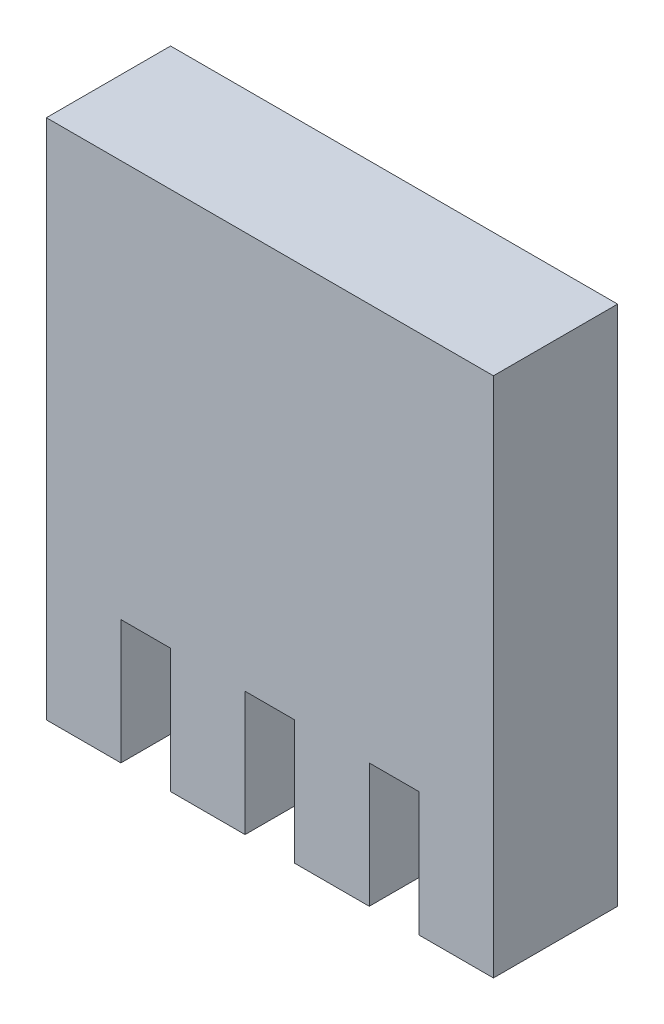
ISO-10303-21;
HEADER;
FILE_DESCRIPTION(('STEP AP214'),'2;1');
FILE_NAME('part.step','',(''),(''),'','','');
FILE_SCHEMA(('AUTOMOTIVE_DESIGN { 1 0 10303 214 1 1 1 1 }'));
ENDSEC;
DATA;
#1=APPLICATION_CONTEXT('core data for automotive mechanical design processes');
#2=APPLICATION_PROTOCOL_DEFINITION('international standard','automotive_design',2000,#1);
#3=PRODUCT_CONTEXT('',#1,'mechanical');
#4=PRODUCT('Part','Part','',(#3));
#5=PRODUCT_RELATED_PRODUCT_CATEGORY('part','',(#4));
#6=PRODUCT_DEFINITION_FORMATION('','',#4);
#7=PRODUCT_DEFINITION_CONTEXT('part definition',#1,'design');
#8=PRODUCT_DEFINITION('design','',#6,#7);
#9=PRODUCT_DEFINITION_SHAPE('','',#8);
#10=(LENGTH_UNIT() NAMED_UNIT(*) SI_UNIT(.MILLI.,.METRE.));
#11=(NAMED_UNIT(*) PLANE_ANGLE_UNIT() SI_UNIT($,.RADIAN.));
#12=(NAMED_UNIT(*) SI_UNIT($,.STERADIAN.) SOLID_ANGLE_UNIT());
#13=UNCERTAINTY_MEASURE_WITH_UNIT(LENGTH_MEASURE(1.E-05),#10,'distance_accuracy_value','');
#14=(GEOMETRIC_REPRESENTATION_CONTEXT(3) GLOBAL_UNCERTAINTY_ASSIGNED_CONTEXT((#13)) GLOBAL_UNIT_ASSIGNED_CONTEXT((#10,
#11,#12)) REPRESENTATION_CONTEXT('',''));
#15=CARTESIAN_POINT('',(0.,0.,0.));
#16=DIRECTION('',(0.,0.,1.));
#17=DIRECTION('',(1.,0.,0.));
#18=AXIS2_PLACEMENT_3D('',#15,#16,#17);
#19=CARTESIAN_POINT('',(0.,0.,5.));
#20=DIRECTION('',(0.,1.,0.));
#21=DIRECTION('',(0.,0.,1.));
#22=AXIS2_PLACEMENT_3D('',#19,#20,#21);
#23=PLANE('',#22);
#24=DIRECTION('',(0.,0.,-1.));
#25=VECTOR('',#24,1.);
#26=CARTESIAN_POINT('',(5.,0.,5.));
#27=LINE('',#26,#25);
#28=CARTESIAN_POINT('',(5.,0.,5.));
#29=VERTEX_POINT('',#28);
#30=CARTESIAN_POINT('',(5.,0.,0.));
#31=VERTEX_POINT('',#30);
#32=EDGE_CURVE('E12',#29,#31,#27,.T.);
#33=ORIENTED_EDGE('',*,*,#32,.F.);
#34=DIRECTION('',(1.,0.,0.));
#35=VECTOR('',#34,1.);
#36=CARTESIAN_POINT('',(0.,0.,5.));
#37=LINE('',#36,#35);
#38=CARTESIAN_POINT('',(3.,0.,5.));
#39=VERTEX_POINT('',#38);
#40=EDGE_CURVE('E252',#39,#29,#37,.T.);
#41=ORIENTED_EDGE('',*,*,#40,.F.);
#42=DIRECTION('',(0.,0.,-1.));
#43=VECTOR('',#42,1.);
#44=CARTESIAN_POINT('',(3.,0.,5.));
#45=LINE('',#44,#43);
#46=CARTESIAN_POINT('',(3.,0.,0.));
#47=VERTEX_POINT('',#46);
#48=EDGE_CURVE('E184',#39,#47,#45,.T.);
#49=ORIENTED_EDGE('',*,*,#48,.T.);
#50=DIRECTION('',(1.,0.,0.));
#51=VECTOR('',#50,1.);
#52=CARTESIAN_POINT('',(0.,0.,0.));
#53=LINE('',#52,#51);
#54=EDGE_CURVE('E220',#47,#31,#53,.T.);
#55=ORIENTED_EDGE('',*,*,#54,.T.);
#56=EDGE_LOOP('',(#33,#41,#49,#55));
#57=FACE_BOUND('',#56,.T.);
#58=ADVANCED_FACE('F82',(#57),#23,.F.);
#59=CARTESIAN_POINT('',(8.,0.,5.));
#60=VERTEX_POINT('',#59);
#61=CARTESIAN_POINT('',(10.,0.,5.));
#62=VERTEX_POINT('',#61);
#63=EDGE_CURVE('E191',#60,#62,#37,.T.);
#64=ORIENTED_EDGE('',*,*,#63,.F.);
#65=DIRECTION('',(0.,0.,-1.));
#66=VECTOR('',#65,1.);
#67=CARTESIAN_POINT('',(8.,0.,5.));
#68=LINE('',#67,#66);
#69=CARTESIAN_POINT('',(8.,0.,0.));
#70=VERTEX_POINT('',#69);
#71=EDGE_CURVE('E92',#60,#70,#68,.T.);
#72=ORIENTED_EDGE('',*,*,#71,.T.);
#73=CARTESIAN_POINT('',(10.,0.,0.));
#74=VERTEX_POINT('',#73);
#75=EDGE_CURVE('E139',#70,#74,#53,.T.);
#76=ORIENTED_EDGE('',*,*,#75,.T.);
#77=DIRECTION('',(0.,0.,-1.));
#78=VECTOR('',#77,1.);
#79=CARTESIAN_POINT('',(10.,0.,5.));
#80=LINE('',#79,#78);
#81=EDGE_CURVE('E151',#62,#74,#80,.T.);
#82=ORIENTED_EDGE('',*,*,#81,.F.);
#83=EDGE_LOOP('',(#64,#72,#76,#82));
#84=FACE_BOUND('',#83,.T.);
#85=ADVANCED_FACE('F329',(#84),#23,.F.);
#86=CARTESIAN_POINT('',(10.,0.,5.));
#87=DIRECTION('',(-1.,0.,0.));
#88=DIRECTION('',(0.,0.,1.));
#89=AXIS2_PLACEMENT_3D('',#86,#87,#88);
#90=PLANE('',#89);
#91=DIRECTION('',(0.,1.,0.));
#92=VECTOR('',#91,1.);
#93=CARTESIAN_POINT('',(10.,0.,0.));
#94=LINE('',#93,#92);
#95=CARTESIAN_POINT('',(10.,-5.,0.));
#96=VERTEX_POINT('',#95);
#97=EDGE_CURVE('E217',#96,#74,#94,.T.);
#98=ORIENTED_EDGE('',*,*,#97,.F.);
#99=DIRECTION('',(0.,0.,-1.));
#100=VECTOR('',#99,1.);
#101=CARTESIAN_POINT('',(10.,-5.,5.));
#102=LINE('',#101,#100);
#103=CARTESIAN_POINT('',(10.,-5.,5.));
#104=VERTEX_POINT('',#103);
#105=EDGE_CURVE('E154',#104,#96,#102,.T.);
#106=ORIENTED_EDGE('',*,*,#105,.F.);
#107=DIRECTION('',(0.,1.,0.));
#108=VECTOR('',#107,1.);
#109=CARTESIAN_POINT('',(10.,0.,5.));
#110=LINE('',#109,#108);
#111=EDGE_CURVE('E249',#104,#62,#110,.T.);
#112=ORIENTED_EDGE('',*,*,#111,.T.);
#113=ORIENTED_EDGE('',*,*,#81,.T.);
#114=EDGE_LOOP('',(#98,#106,#112,#113));
#115=FACE_BOUND('',#114,.T.);
#116=ADVANCED_FACE('F336',(#115),#90,.T.);
#117=CARTESIAN_POINT('',(0.,-5.,5.));
#118=DIRECTION('',(0.,1.,0.));
#119=DIRECTION('',(0.,0.,1.));
#120=AXIS2_PLACEMENT_3D('',#117,#118,#119);
#121=PLANE('',#120);
#122=DIRECTION('',(1.,0.,0.));
#123=VECTOR('',#122,1.);
#124=CARTESIAN_POINT('',(0.,-5.,0.));
#125=LINE('',#124,#123);
#126=CARTESIAN_POINT('',(13.,-5.,0.));
#127=VERTEX_POINT('',#126);
#128=EDGE_CURVE('E214',#96,#127,#125,.T.);
#129=ORIENTED_EDGE('',*,*,#128,.T.);
#130=DIRECTION('',(0.,0.,-1.));
#131=VECTOR('',#130,1.);
#132=CARTESIAN_POINT('',(13.,-5.,5.));
#133=LINE('',#132,#131);
#134=CARTESIAN_POINT('',(13.,-5.,5.));
#135=VERTEX_POINT('',#134);
#136=EDGE_CURVE('E157',#135,#127,#133,.T.);
#137=ORIENTED_EDGE('',*,*,#136,.F.);
#138=DIRECTION('',(1.,0.,0.));
#139=VECTOR('',#138,1.);
#140=CARTESIAN_POINT('',(0.,-5.,5.));
#141=LINE('',#140,#139);
#142=EDGE_CURVE('E246',#104,#135,#141,.T.);
#143=ORIENTED_EDGE('',*,*,#142,.F.);
#144=ORIENTED_EDGE('',*,*,#105,.T.);
#145=EDGE_LOOP('',(#129,#137,#143,#144));
#146=FACE_BOUND('',#145,.T.);
#147=ADVANCED_FACE('F347',(#146),#121,.F.);
#148=CARTESIAN_POINT('',(13.,0.,5.));
#149=DIRECTION('',(-1.,0.,0.));
#150=DIRECTION('',(0.,0.,1.));
#151=AXIS2_PLACEMENT_3D('',#148,#149,#150);
#152=PLANE('',#151);
#153=DIRECTION('',(0.,1.,0.));
#154=VECTOR('',#153,1.);
#155=CARTESIAN_POINT('',(13.,0.,0.));
#156=LINE('',#155,#154);
#157=CARTESIAN_POINT('',(13.,0.,0.));
#158=VERTEX_POINT('',#157);
#159=EDGE_CURVE('E211',#127,#158,#156,.T.);
#160=ORIENTED_EDGE('',*,*,#159,.T.);
#161=DIRECTION('',(0.,0.,-1.));
#162=VECTOR('',#161,1.);
#163=CARTESIAN_POINT('',(13.,0.,5.));
#164=LINE('',#163,#162);
#165=CARTESIAN_POINT('',(13.,0.,5.));
#166=VERTEX_POINT('',#165);
#167=EDGE_CURVE('E160',#166,#158,#164,.T.);
#168=ORIENTED_EDGE('',*,*,#167,.F.);
#169=DIRECTION('',(0.,1.,0.));
#170=VECTOR('',#169,1.);
#171=CARTESIAN_POINT('',(13.,0.,5.));
#172=LINE('',#171,#170);
#173=EDGE_CURVE('E243',#135,#166,#172,.T.);
#174=ORIENTED_EDGE('',*,*,#173,.F.);
#175=ORIENTED_EDGE('',*,*,#136,.T.);
#176=EDGE_LOOP('',(#160,#168,#174,#175));
#177=FACE_BOUND('',#176,.T.);
#178=ADVANCED_FACE('F349',(#177),#152,.F.);
#179=CARTESIAN_POINT('',(15.,0.,0.));
#180=VERTEX_POINT('',#179);
#181=EDGE_CURVE('E210',#158,#180,#53,.T.);
#182=ORIENTED_EDGE('',*,*,#181,.T.);
#183=DIRECTION('',(0.,0.,-1.));
#184=VECTOR('',#183,1.);
#185=CARTESIAN_POINT('',(15.,0.,5.));
#186=LINE('',#185,#184);
#187=CARTESIAN_POINT('',(15.,0.,5.));
#188=VERTEX_POINT('',#187);
#189=EDGE_CURVE('E163',#188,#180,#186,.T.);
#190=ORIENTED_EDGE('',*,*,#189,.F.);
#191=EDGE_CURVE('E242',#166,#188,#37,.T.);
#192=ORIENTED_EDGE('',*,*,#191,.F.);
#193=ORIENTED_EDGE('',*,*,#167,.T.);
#194=EDGE_LOOP('',(#182,#190,#192,#193));
#195=FACE_BOUND('',#194,.T.);
#196=ADVANCED_FACE('F271',(#195),#23,.F.);
#197=CARTESIAN_POINT('',(15.,0.,5.));
#198=DIRECTION('',(-1.,0.,0.));
#199=DIRECTION('',(0.,0.,1.));
#200=AXIS2_PLACEMENT_3D('',#197,#198,#199);
#201=PLANE('',#200);
#202=DIRECTION('',(0.,1.,0.));
#203=VECTOR('',#202,1.);
#204=CARTESIAN_POINT('',(15.,0.,0.));
#205=LINE('',#204,#203);
#206=CARTESIAN_POINT('',(15.,-5.,0.));
#207=VERTEX_POINT('',#206);
#208=EDGE_CURVE('E207',#207,#180,#205,.T.);
#209=ORIENTED_EDGE('',*,*,#208,.F.);
#210=DIRECTION('',(0.,0.,-1.));
#211=VECTOR('',#210,1.);
#212=CARTESIAN_POINT('',(15.,-5.,5.));
#213=LINE('',#212,#211);
#214=CARTESIAN_POINT('',(15.,-5.,5.));
#215=VERTEX_POINT('',#214);
#216=EDGE_CURVE('E166',#215,#207,#213,.T.);
#217=ORIENTED_EDGE('',*,*,#216,.F.);
#218=DIRECTION('',(0.,1.,0.));
#219=VECTOR('',#218,1.);
#220=CARTESIAN_POINT('',(15.,0.,5.));
#221=LINE('',#220,#219);
#222=EDGE_CURVE('E239',#215,#188,#221,.T.);
#223=ORIENTED_EDGE('',*,*,#222,.T.);
#224=ORIENTED_EDGE('',*,*,#189,.T.);
#225=EDGE_LOOP('',(#209,#217,#223,#224));
#226=FACE_BOUND('',#225,.T.);
#227=ADVANCED_FACE('F277',(#226),#201,.T.);
#228=CARTESIAN_POINT('',(0.,-5.,5.));
#229=DIRECTION('',(0.,1.,0.));
#230=DIRECTION('',(0.,0.,1.));
#231=AXIS2_PLACEMENT_3D('',#228,#229,#230);
#232=PLANE('',#231);
#233=DIRECTION('',(1.,0.,0.));
#234=VECTOR('',#233,1.);
#235=CARTESIAN_POINT('',(0.,-5.,0.));
#236=LINE('',#235,#234);
#237=CARTESIAN_POINT('',(18.,-5.,0.));
#238=VERTEX_POINT('',#237);
#239=EDGE_CURVE('E204',#207,#238,#236,.T.);
#240=ORIENTED_EDGE('',*,*,#239,.T.);
#241=DIRECTION('',(0.,0.,-1.));
#242=VECTOR('',#241,1.);
#243=CARTESIAN_POINT('',(18.,-5.,5.));
#244=LINE('',#243,#242);
#245=CARTESIAN_POINT('',(18.,-5.,5.));
#246=VERTEX_POINT('',#245);
#247=EDGE_CURVE('E169',#246,#238,#244,.T.);
#248=ORIENTED_EDGE('',*,*,#247,.F.);
#249=DIRECTION('',(1.,0.,0.));
#250=VECTOR('',#249,1.);
#251=CARTESIAN_POINT('',(0.,-5.,5.));
#252=LINE('',#251,#250);
#253=EDGE_CURVE('E236',#215,#246,#252,.T.);
#254=ORIENTED_EDGE('',*,*,#253,.F.);
#255=ORIENTED_EDGE('',*,*,#216,.T.);
#256=EDGE_LOOP('',(#240,#248,#254,#255));
#257=FACE_BOUND('',#256,.T.);
#258=ADVANCED_FACE('F285',(#257),#232,.F.);
#259=CARTESIAN_POINT('',(18.,0.,5.));
#260=DIRECTION('',(-1.,0.,0.));
#261=DIRECTION('',(0.,0.,1.));
#262=AXIS2_PLACEMENT_3D('',#259,#260,#261);
#263=PLANE('',#262);
#264=DIRECTION('',(0.,1.,0.));
#265=VECTOR('',#264,1.);
#266=CARTESIAN_POINT('',(18.,0.,0.));
#267=LINE('',#266,#265);
#268=CARTESIAN_POINT('',(18.,16.,0.));
#269=VERTEX_POINT('',#268);
#270=EDGE_CURVE('E201',#238,#269,#267,.T.);
#271=ORIENTED_EDGE('',*,*,#270,.T.);
#272=DIRECTION('',(0.,0.,-1.));
#273=VECTOR('',#272,1.);
#274=CARTESIAN_POINT('',(18.,16.,5.));
#275=LINE('',#274,#273);
#276=CARTESIAN_POINT('',(18.,16.,5.));
#277=VERTEX_POINT('',#276);
#278=EDGE_CURVE('E172',#277,#269,#275,.T.);
#279=ORIENTED_EDGE('',*,*,#278,.F.);
#280=DIRECTION('',(0.,1.,0.));
#281=VECTOR('',#280,1.);
#282=CARTESIAN_POINT('',(18.,0.,5.));
#283=LINE('',#282,#281);
#284=EDGE_CURVE('E233',#246,#277,#283,.T.);
#285=ORIENTED_EDGE('',*,*,#284,.F.);
#286=ORIENTED_EDGE('',*,*,#247,.T.);
#287=EDGE_LOOP('',(#271,#279,#285,#286));
#288=FACE_BOUND('',#287,.T.);
#289=ADVANCED_FACE('F352',(#288),#263,.F.);
#290=CARTESIAN_POINT('',(0.,16.,5.));
#291=DIRECTION('',(0.,1.,0.));
#292=DIRECTION('',(0.,0.,1.));
#293=AXIS2_PLACEMENT_3D('',#290,#291,#292);
#294=PLANE('',#293);
#295=DIRECTION('',(1.,0.,0.));
#296=VECTOR('',#295,1.);
#297=CARTESIAN_POINT('',(0.,16.,0.));
#298=LINE('',#297,#296);
#299=CARTESIAN_POINT('',(0.,16.,0.));
#300=VERTEX_POINT('',#299);
#301=EDGE_CURVE('E198',#300,#269,#298,.T.);
#302=ORIENTED_EDGE('',*,*,#301,.F.);
#303=DIRECTION('',(0.,0.,-1.));
#304=VECTOR('',#303,1.);
#305=CARTESIAN_POINT('',(0.,16.,5.));
#306=LINE('',#305,#304);
#307=CARTESIAN_POINT('',(0.,16.,5.));
#308=VERTEX_POINT('',#307);
#309=EDGE_CURVE('E175',#308,#300,#306,.T.);
#310=ORIENTED_EDGE('',*,*,#309,.F.);
#311=DIRECTION('',(1.,0.,0.));
#312=VECTOR('',#311,1.);
#313=CARTESIAN_POINT('',(0.,16.,5.));
#314=LINE('',#313,#312);
#315=EDGE_CURVE('E230',#308,#277,#314,.T.);
#316=ORIENTED_EDGE('',*,*,#315,.T.);
#317=ORIENTED_EDGE('',*,*,#278,.T.);
#318=EDGE_LOOP('',(#302,#310,#316,#317));
#319=FACE_BOUND('',#318,.T.);
#320=ADVANCED_FACE('F355',(#319),#294,.T.);
#321=CARTESIAN_POINT('',(0.,0.,5.));
#322=DIRECTION('',(-1.,0.,0.));
#323=DIRECTION('',(0.,0.,1.));
#324=AXIS2_PLACEMENT_3D('',#321,#322,#323);
#325=PLANE('',#324);
#326=DIRECTION('',(0.,1.,0.));
#327=VECTOR('',#326,1.);
#328=CARTESIAN_POINT('',(0.,0.,0.));
#329=LINE('',#328,#327);
#330=CARTESIAN_POINT('',(0.,-5.,0.));
#331=VERTEX_POINT('',#330);
#332=EDGE_CURVE('E195',#331,#300,#329,.T.);
#333=ORIENTED_EDGE('',*,*,#332,.F.);
#334=DIRECTION('',(0.,0.,-1.));
#335=VECTOR('',#334,1.);
#336=CARTESIAN_POINT('',(0.,-5.,5.));
#337=LINE('',#336,#335);
#338=CARTESIAN_POINT('',(0.,-5.,5.));
#339=VERTEX_POINT('',#338);
#340=EDGE_CURVE('E178',#339,#331,#337,.T.);
#341=ORIENTED_EDGE('',*,*,#340,.F.);
#342=DIRECTION('',(0.,1.,0.));
#343=VECTOR('',#342,1.);
#344=CARTESIAN_POINT('',(0.,0.,5.));
#345=LINE('',#344,#343);
#346=EDGE_CURVE('E227',#339,#308,#345,.T.);
#347=ORIENTED_EDGE('',*,*,#346,.T.);
#348=ORIENTED_EDGE('',*,*,#309,.T.);
#349=EDGE_LOOP('',(#333,#341,#347,#348));
#350=FACE_BOUND('',#349,.T.);
#351=ADVANCED_FACE('F359',(#350),#325,.T.);
#352=CARTESIAN_POINT('',(0.,-5.,5.));
#353=DIRECTION('',(0.,1.,0.));
#354=DIRECTION('',(0.,0.,1.));
#355=AXIS2_PLACEMENT_3D('',#352,#353,#354);
#356=PLANE('',#355);
#357=DIRECTION('',(1.,0.,0.));
#358=VECTOR('',#357,1.);
#359=CARTESIAN_POINT('',(0.,-5.,0.));
#360=LINE('',#359,#358);
#361=CARTESIAN_POINT('',(3.,-5.,0.));
#362=VERTEX_POINT('',#361);
#363=EDGE_CURVE('E192',#331,#362,#360,.T.);
#364=ORIENTED_EDGE('',*,*,#363,.T.);
#365=DIRECTION('',(0.,0.,-1.));
#366=VECTOR('',#365,1.);
#367=CARTESIAN_POINT('',(3.,-5.,5.));
#368=LINE('',#367,#366);
#369=CARTESIAN_POINT('',(3.,-5.,5.));
#370=VERTEX_POINT('',#369);
#371=EDGE_CURVE('E181',#370,#362,#368,.T.);
#372=ORIENTED_EDGE('',*,*,#371,.F.);
#373=DIRECTION('',(1.,0.,0.));
#374=VECTOR('',#373,1.);
#375=CARTESIAN_POINT('',(0.,-5.,5.));
#376=LINE('',#375,#374);
#377=EDGE_CURVE('E224',#339,#370,#376,.T.);
#378=ORIENTED_EDGE('',*,*,#377,.F.);
#379=ORIENTED_EDGE('',*,*,#340,.T.);
#380=EDGE_LOOP('',(#364,#372,#378,#379));
#381=FACE_BOUND('',#380,.T.);
#382=ADVANCED_FACE('F364',(#381),#356,.F.);
#383=CARTESIAN_POINT('',(3.,0.,5.));
#384=DIRECTION('',(1.,0.,0.));
#385=DIRECTION('',(0.,1.,0.));
#386=AXIS2_PLACEMENT_3D('',#383,#384,#385);
#387=PLANE('',#386);
#388=DIRECTION('',(0.,-1.,0.));
#389=VECTOR('',#388,1.);
#390=CARTESIAN_POINT('',(3.,0.,0.));
#391=LINE('',#390,#389);
#392=EDGE_CURVE('E188',#47,#362,#391,.T.);
#393=ORIENTED_EDGE('',*,*,#392,.F.);
#394=ORIENTED_EDGE('',*,*,#48,.F.);
#395=DIRECTION('',(0.,-1.,0.));
#396=VECTOR('',#395,1.);
#397=CARTESIAN_POINT('',(3.,0.,5.));
#398=LINE('',#397,#396);
#399=EDGE_CURVE('E187',#39,#370,#398,.T.);
#400=ORIENTED_EDGE('',*,*,#399,.T.);
#401=ORIENTED_EDGE('',*,*,#371,.T.);
#402=EDGE_LOOP('',(#393,#394,#400,#401));
#403=FACE_BOUND('',#402,.T.);
#404=ADVANCED_FACE('F367',(#403),#387,.T.);
#405=CARTESIAN_POINT('',(0.,0.,5.));
#406=DIRECTION('',(0.,0.,1.));
#407=DIRECTION('',(1.,0.,0.));
#408=AXIS2_PLACEMENT_3D('',#405,#406,#407);
#409=PLANE('',#408);
#410=ORIENTED_EDGE('',*,*,#40,.T.);
#411=DIRECTION('',(0.,-1.,0.));
#412=VECTOR('',#411,1.);
#413=CARTESIAN_POINT('',(5.,0.,5.));
#414=LINE('',#413,#412);
#415=CARTESIAN_POINT('',(5.,-5.,5.));
#416=VERTEX_POINT('',#415);
#417=EDGE_CURVE('E146',#29,#416,#414,.T.);
#418=ORIENTED_EDGE('',*,*,#417,.T.);
#419=DIRECTION('',(1.,0.,0.));
#420=VECTOR('',#419,1.);
#421=CARTESIAN_POINT('',(5.,-5.,5.));
#422=LINE('',#421,#420);
#423=CARTESIAN_POINT('',(8.,-5.,5.));
#424=VERTEX_POINT('',#423);
#425=EDGE_CURVE('E138',#416,#424,#422,.T.);
#426=ORIENTED_EDGE('',*,*,#425,.T.);
#427=DIRECTION('',(0.,-1.,0.));
#428=VECTOR('',#427,1.);
#429=CARTESIAN_POINT('',(8.,0.,5.));
#430=LINE('',#429,#428);
#431=EDGE_CURVE('E132',#60,#424,#430,.T.);
#432=ORIENTED_EDGE('',*,*,#431,.F.);
#433=ORIENTED_EDGE('',*,*,#63,.T.);
#434=ORIENTED_EDGE('',*,*,#111,.F.);
#435=ORIENTED_EDGE('',*,*,#142,.T.);
#436=ORIENTED_EDGE('',*,*,#173,.T.);
#437=ORIENTED_EDGE('',*,*,#191,.T.);
#438=ORIENTED_EDGE('',*,*,#222,.F.);
#439=ORIENTED_EDGE('',*,*,#253,.T.);
#440=ORIENTED_EDGE('',*,*,#284,.T.);
#441=ORIENTED_EDGE('',*,*,#315,.F.);
#442=ORIENTED_EDGE('',*,*,#346,.F.);
#443=ORIENTED_EDGE('',*,*,#377,.T.);
#444=ORIENTED_EDGE('',*,*,#399,.F.);
#445=EDGE_LOOP('',(#410,#418,#426,#432,#433,#434,#435,#436,#437,#438,#439,#440,#441,#442,#443,#444));
#446=FACE_BOUND('',#445,.T.);
#447=ADVANCED_FACE('F263',(#446),#409,.T.);
#448=CARTESIAN_POINT('',(0.,0.,0.));
#449=DIRECTION('',(0.,0.,1.));
#450=DIRECTION('',(1.,0.,0.));
#451=AXIS2_PLACEMENT_3D('',#448,#449,#450);
#452=PLANE('',#451);
#453=ORIENTED_EDGE('',*,*,#54,.F.);
#454=ORIENTED_EDGE('',*,*,#392,.T.);
#455=ORIENTED_EDGE('',*,*,#363,.F.);
#456=ORIENTED_EDGE('',*,*,#332,.T.);
#457=ORIENTED_EDGE('',*,*,#301,.T.);
#458=ORIENTED_EDGE('',*,*,#270,.F.);
#459=ORIENTED_EDGE('',*,*,#239,.F.);
#460=ORIENTED_EDGE('',*,*,#208,.T.);
#461=ORIENTED_EDGE('',*,*,#181,.F.);
#462=ORIENTED_EDGE('',*,*,#159,.F.);
#463=ORIENTED_EDGE('',*,*,#128,.F.);
#464=ORIENTED_EDGE('',*,*,#97,.T.);
#465=ORIENTED_EDGE('',*,*,#75,.F.);
#466=DIRECTION('',(0.,-1.,0.));
#467=VECTOR('',#466,1.);
#468=CARTESIAN_POINT('',(8.,0.,0.));
#469=LINE('',#468,#467);
#470=CARTESIAN_POINT('',(8.,-5.,0.));
#471=VERTEX_POINT('',#470);
#472=EDGE_CURVE('E142',#70,#471,#469,.T.);
#473=ORIENTED_EDGE('',*,*,#472,.T.);
#474=DIRECTION('',(1.,0.,0.));
#475=VECTOR('',#474,1.);
#476=CARTESIAN_POINT('',(5.,-5.,0.));
#477=LINE('',#476,#475);
#478=CARTESIAN_POINT('',(5.,-5.,0.));
#479=VERTEX_POINT('',#478);
#480=EDGE_CURVE('E133',#479,#471,#477,.T.);
#481=ORIENTED_EDGE('',*,*,#480,.F.);
#482=DIRECTION('',(0.,-1.,0.));
#483=VECTOR('',#482,1.);
#484=CARTESIAN_POINT('',(5.,0.,0.));
#485=LINE('',#484,#483);
#486=EDGE_CURVE('E121',#31,#479,#485,.T.);
#487=ORIENTED_EDGE('',*,*,#486,.F.);
#488=EDGE_LOOP('',(#453,#454,#455,#456,#457,#458,#459,#460,#461,#462,#463,#464,#465,#473,#481,#487));
#489=FACE_BOUND('',#488,.T.);
#490=ADVANCED_FACE('F140',(#489),#452,.F.);
#491=CARTESIAN_POINT('',(5.,0.,5.));
#492=DIRECTION('',(1.,0.,0.));
#493=DIRECTION('',(0.,0.,-1.));
#494=AXIS2_PLACEMENT_3D('',#491,#492,#493);
#495=PLANE('',#494);
#496=ORIENTED_EDGE('',*,*,#486,.T.);
#497=DIRECTION('',(0.,0.,-1.));
#498=VECTOR('',#497,1.);
#499=CARTESIAN_POINT('',(5.,-5.,5.));
#500=LINE('',#499,#498);
#501=EDGE_CURVE('E125',#416,#479,#500,.T.);
#502=ORIENTED_EDGE('',*,*,#501,.F.);
#503=ORIENTED_EDGE('',*,*,#417,.F.);
#504=ORIENTED_EDGE('',*,*,#32,.T.);
#505=EDGE_LOOP('',(#496,#502,#503,#504));
#506=FACE_BOUND('',#505,.T.);
#507=ADVANCED_FACE('F123',(#506),#495,.F.);
#508=CARTESIAN_POINT('',(5.,-5.,5.));
#509=DIRECTION('',(0.,1.,0.));
#510=DIRECTION('',(0.,0.,1.));
#511=AXIS2_PLACEMENT_3D('',#508,#509,#510);
#512=PLANE('',#511);
#513=ORIENTED_EDGE('',*,*,#480,.T.);
#514=DIRECTION('',(0.,0.,-1.));
#515=VECTOR('',#514,1.);
#516=CARTESIAN_POINT('',(8.,-5.,5.));
#517=LINE('',#516,#515);
#518=EDGE_CURVE('E86',#424,#471,#517,.T.);
#519=ORIENTED_EDGE('',*,*,#518,.F.);
#520=ORIENTED_EDGE('',*,*,#425,.F.);
#521=ORIENTED_EDGE('',*,*,#501,.T.);
#522=EDGE_LOOP('',(#513,#519,#520,#521));
#523=FACE_BOUND('',#522,.T.);
#524=ADVANCED_FACE('F136',(#523),#512,.F.);
#525=CARTESIAN_POINT('',(8.,0.,5.));
#526=DIRECTION('',(1.,0.,0.));
#527=DIRECTION('',(0.,0.,-1.));
#528=AXIS2_PLACEMENT_3D('',#525,#526,#527);
#529=PLANE('',#528);
#530=ORIENTED_EDGE('',*,*,#472,.F.);
#531=ORIENTED_EDGE('',*,*,#71,.F.);
#532=ORIENTED_EDGE('',*,*,#431,.T.);
#533=ORIENTED_EDGE('',*,*,#518,.T.);
#534=EDGE_LOOP('',(#530,#531,#532,#533));
#535=FACE_BOUND('',#534,.T.);
#536=ADVANCED_FACE('F84',(#535),#529,.T.);
#537=CLOSED_SHELL('',(#58,#85,#116,#147,#178,#196,#227,#258,#289,#320,#351,#382,#404,#447,#490,
#507,#524,#536));
#538=MANIFOLD_SOLID_BREP('B2',#537);
#539=ADVANCED_BREP_SHAPE_REPRESENTATION('',(#18,#538),#14);
#540=SHAPE_DEFINITION_REPRESENTATION(#9,#539);
ENDSEC;
END-ISO-10303-21;
